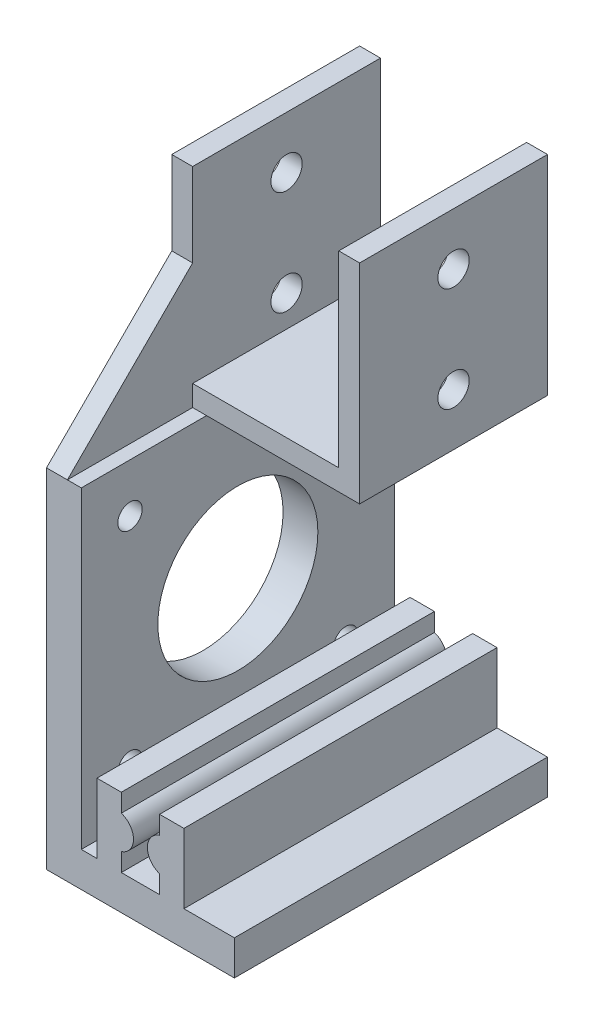
ISO-10303-21;
HEADER;
FILE_DESCRIPTION(('STEP AP214'),'2;1');
FILE_NAME('part.step','',(''),(''),'','','');
FILE_SCHEMA(('AUTOMOTIVE_DESIGN { 1 0 10303 214 1 1 1 1 }'));
ENDSEC;
DATA;
#1=APPLICATION_CONTEXT('core data for automotive mechanical design processes');
#2=APPLICATION_PROTOCOL_DEFINITION('international standard','automotive_design',2000,#1);
#3=PRODUCT_CONTEXT('',#1,'mechanical');
#4=PRODUCT('Part','Part','',(#3));
#5=PRODUCT_RELATED_PRODUCT_CATEGORY('part','',(#4));
#6=PRODUCT_DEFINITION_FORMATION('','',#4);
#7=PRODUCT_DEFINITION_CONTEXT('part definition',#1,'design');
#8=PRODUCT_DEFINITION('design','',#6,#7);
#9=PRODUCT_DEFINITION_SHAPE('','',#8);
#10=(LENGTH_UNIT() NAMED_UNIT(*) SI_UNIT(.MILLI.,.METRE.));
#11=(NAMED_UNIT(*) PLANE_ANGLE_UNIT() SI_UNIT($,.RADIAN.));
#12=(NAMED_UNIT(*) SI_UNIT($,.STERADIAN.) SOLID_ANGLE_UNIT());
#13=UNCERTAINTY_MEASURE_WITH_UNIT(LENGTH_MEASURE(1.E-05),#10,'distance_accuracy_value','');
#14=(GEOMETRIC_REPRESENTATION_CONTEXT(3) GLOBAL_UNCERTAINTY_ASSIGNED_CONTEXT((#13)) GLOBAL_UNIT_ASSIGNED_CONTEXT((#10,
#11,#12)) REPRESENTATION_CONTEXT('',''));
#15=CARTESIAN_POINT('',(0.,0.,0.));
#16=DIRECTION('',(0.,0.,1.));
#17=DIRECTION('',(1.,0.,0.));
#18=AXIS2_PLACEMENT_3D('',#15,#16,#17);
#19=CARTESIAN_POINT('',(-13.5,30.0000000000001,13.5));
#20=DIRECTION('',(0.,0.,-1.));
#21=DIRECTION('',(-1.,0.,0.));
#22=AXIS2_PLACEMENT_3D('',#19,#20,#21);
#23=PLANE('',#22);
#24=DIRECTION('',(1.,0.,0.));
#25=VECTOR('',#24,1.);
#26=CARTESIAN_POINT('',(-38.9558441227157,18.,13.5));
#27=LINE('',#26,#25);
#28=CARTESIAN_POINT('',(-13.5,18.,13.5));
#29=VERTEX_POINT('',#28);
#30=CARTESIAN_POINT('',(-10.5,18.,13.5));
#31=VERTEX_POINT('',#30);
#32=EDGE_CURVE('E246',#29,#31,#27,.T.);
#33=ORIENTED_EDGE('',*,*,#32,.T.);
#34=DIRECTION('',(0.,1.,0.));
#35=VECTOR('',#34,1.);
#36=CARTESIAN_POINT('',(-10.5,30.0000000000001,13.5));
#37=LINE('',#36,#35);
#38=CARTESIAN_POINT('',(-10.5,30.0000000000001,13.5));
#39=VERTEX_POINT('',#38);
#40=EDGE_CURVE('E255',#31,#39,#37,.T.);
#41=ORIENTED_EDGE('',*,*,#40,.T.);
#42=DIRECTION('',(1.,0.,0.));
#43=VECTOR('',#42,1.);
#44=CARTESIAN_POINT('',(-13.5,30.0000000000001,13.5));
#45=LINE('',#44,#43);
#46=CARTESIAN_POINT('',(-13.5,30.0000000000001,13.5));
#47=VERTEX_POINT('',#46);
#48=EDGE_CURVE('E352',#47,#39,#45,.T.);
#49=ORIENTED_EDGE('',*,*,#48,.F.);
#50=DIRECTION('',(0.,-1.,0.));
#51=VECTOR('',#50,1.);
#52=CARTESIAN_POINT('',(-13.5,30.0000000000001,13.5));
#53=LINE('',#52,#51);
#54=EDGE_CURVE('E370',#47,#29,#53,.T.);
#55=ORIENTED_EDGE('',*,*,#54,.T.);
#56=EDGE_LOOP('',(#33,#41,#49,#55));
#57=FACE_BOUND('',#56,.T.);
#58=ADVANCED_FACE('F56',(#57),#23,.F.);
#59=CARTESIAN_POINT('',(13.5,-45.,-13.5));
#60=DIRECTION('',(0.,-1.,0.));
#61=DIRECTION('',(0.,0.,-1.));
#62=AXIS2_PLACEMENT_3D('',#59,#60,#61);
#63=PLANE('',#62);
#64=DIRECTION('',(0.,0.,1.));
#65=VECTOR('',#64,1.);
#66=CARTESIAN_POINT('',(2.75,-44.9999999999999,-13.5));
#67=LINE('',#66,#65);
#68=CARTESIAN_POINT('',(2.75,-44.9999999999999,-13.5));
#69=VERTEX_POINT('',#68);
#70=CARTESIAN_POINT('',(2.75,-44.9999999999999,31.5));
#71=VERTEX_POINT('',#70);
#72=EDGE_CURVE('E618',#69,#71,#67,.T.);
#73=ORIENTED_EDGE('',*,*,#72,.F.);
#74=DIRECTION('',(-1.,0.,0.));
#75=VECTOR('',#74,1.);
#76=CARTESIAN_POINT('',(13.5,-45.,-13.5));
#77=LINE('',#76,#75);
#78=CARTESIAN_POINT('',(-2.75,-45.,-13.5));
#79=VERTEX_POINT('',#78);
#80=EDGE_CURVE('E746',#69,#79,#77,.T.);
#81=ORIENTED_EDGE('',*,*,#80,.T.);
#82=DIRECTION('',(0.,0.,1.));
#83=VECTOR('',#82,1.);
#84=CARTESIAN_POINT('',(-2.75,-45.,-13.5));
#85=LINE('',#84,#83);
#86=CARTESIAN_POINT('',(-2.75,-45.,31.5));
#87=VERTEX_POINT('',#86);
#88=EDGE_CURVE('E696',#79,#87,#85,.T.);
#89=ORIENTED_EDGE('',*,*,#88,.T.);
#90=DIRECTION('',(-1.,0.,0.));
#91=VECTOR('',#90,1.);
#92=CARTESIAN_POINT('',(13.5,-45.,31.5));
#93=LINE('',#92,#91);
#94=EDGE_CURVE('E740',#71,#87,#93,.T.);
#95=ORIENTED_EDGE('',*,*,#94,.F.);
#96=EDGE_LOOP('',(#73,#81,#89,#95));
#97=FACE_BOUND('',#96,.T.);
#98=ADVANCED_FACE('F461',(#97),#63,.F.);
#99=DIRECTION('',(0.,0.,1.));
#100=VECTOR('',#99,1.);
#101=CARTESIAN_POINT('',(-6.25,-45.,-13.5));
#102=LINE('',#101,#100);
#103=CARTESIAN_POINT('',(-6.25,-45.,-13.5));
#104=VERTEX_POINT('',#103);
#105=CARTESIAN_POINT('',(-6.24999999999999,-45.,31.5));
#106=VERTEX_POINT('',#105);
#107=EDGE_CURVE('E701',#104,#106,#102,.T.);
#108=ORIENTED_EDGE('',*,*,#107,.F.);
#109=CARTESIAN_POINT('',(-8.5,-44.9999999999999,-13.5));
#110=VERTEX_POINT('',#109);
#111=EDGE_CURVE('E739',#104,#110,#77,.T.);
#112=ORIENTED_EDGE('',*,*,#111,.T.);
#113=DIRECTION('',(0.,0.,1.));
#114=VECTOR('',#113,1.);
#115=CARTESIAN_POINT('',(-8.5,-44.9999999999999,-13.5));
#116=LINE('',#115,#114);
#117=CARTESIAN_POINT('',(-8.49999999999999,-44.9999999999999,31.5));
#118=VERTEX_POINT('',#117);
#119=EDGE_CURVE('E700',#110,#118,#116,.T.);
#120=ORIENTED_EDGE('',*,*,#119,.T.);
#121=EDGE_CURVE('E731',#106,#118,#93,.T.);
#122=ORIENTED_EDGE('',*,*,#121,.F.);
#123=EDGE_LOOP('',(#108,#112,#120,#122));
#124=FACE_BOUND('',#123,.T.);
#125=ADVANCED_FACE('F467',(#124),#63,.F.);
#126=CARTESIAN_POINT('',(-8.5,-44.9999999999999,-13.5));
#127=DIRECTION('',(-1.,0.,0.));
#128=DIRECTION('',(0.,0.,1.));
#129=AXIS2_PLACEMENT_3D('',#126,#127,#128);
#130=PLANE('',#129);
#131=CARTESIAN_POINT('',(-8.5,-37.9999999999999,24.5));
#132=DIRECTION('',(1.,0.,0.));
#133=DIRECTION('',(0.,0.,-1.));
#134=AXIS2_PLACEMENT_3D('',#131,#132,#133);
#135=CIRCLE('',#134,1.75);
#136=CARTESIAN_POINT('',(-8.5,-37.9999999999999,22.75));
#137=VERTEX_POINT('',#136);
#138=EDGE_CURVE('E761',#137,#137,#135,.T.);
#139=ORIENTED_EDGE('',*,*,#138,.F.);
#140=EDGE_LOOP('',(#139));
#141=FACE_BOUND('',#140,.T.);
#142=CARTESIAN_POINT('',(-8.5,-6.9999999999999,24.5));
#143=DIRECTION('',(1.,0.,0.));
#144=DIRECTION('',(0.,0.,-1.));
#145=AXIS2_PLACEMENT_3D('',#142,#143,#144);
#146=CIRCLE('',#145,1.75);
#147=CARTESIAN_POINT('',(-8.5,-6.9999999999999,22.75));
#148=VERTEX_POINT('',#147);
#149=EDGE_CURVE('E757',#148,#148,#146,.T.);
#150=ORIENTED_EDGE('',*,*,#149,.F.);
#151=EDGE_LOOP('',(#150));
#152=FACE_BOUND('',#151,.T.);
#153=CARTESIAN_POINT('',(-8.49999999999999,-6.9999999999999,-6.49999999999999));
#154=DIRECTION('',(1.,0.,0.));
#155=DIRECTION('',(0.,0.,-1.));
#156=AXIS2_PLACEMENT_3D('',#153,#154,#155);
#157=CIRCLE('',#156,1.75);
#158=CARTESIAN_POINT('',(-8.49999999999999,-6.9999999999999,-8.24999999999999));
#159=VERTEX_POINT('',#158);
#160=EDGE_CURVE('E762',#159,#159,#157,.T.);
#161=ORIENTED_EDGE('',*,*,#160,.F.);
#162=EDGE_LOOP('',(#161));
#163=FACE_BOUND('',#162,.T.);
#164=CARTESIAN_POINT('',(-8.49999999999999,-37.9999999999999,-6.49999999999999));
#165=DIRECTION('',(1.,0.,0.));
#166=DIRECTION('',(0.,0.,-1.));
#167=AXIS2_PLACEMENT_3D('',#164,#165,#166);
#168=CIRCLE('',#167,1.75);
#169=CARTESIAN_POINT('',(-8.49999999999999,-37.9999999999999,-8.24999999999999));
#170=VERTEX_POINT('',#169);
#171=EDGE_CURVE('E766',#170,#170,#168,.T.);
#172=ORIENTED_EDGE('',*,*,#171,.F.);
#173=EDGE_LOOP('',(#172));
#174=FACE_BOUND('',#173,.T.);
#175=CARTESIAN_POINT('',(-8.5,-22.5,9.00000000000001));
#176=DIRECTION('',(1.,0.,0.));
#177=DIRECTION('',(0.,0.,-1.));
#178=AXIS2_PLACEMENT_3D('',#175,#176,#177);
#179=CIRCLE('',#178,11.5);
#180=CARTESIAN_POINT('',(-8.5,-22.5,-2.49999999999999));
#181=VERTEX_POINT('',#180);
#182=EDGE_CURVE('E754',#181,#181,#179,.T.);
#183=ORIENTED_EDGE('',*,*,#182,.F.);
#184=EDGE_LOOP('',(#183));
#185=FACE_BOUND('',#184,.T.);
#186=ORIENTED_EDGE('',*,*,#119,.F.);
#187=DIRECTION('',(0.,1.,0.));
#188=VECTOR('',#187,1.);
#189=CARTESIAN_POINT('',(-8.5,-44.9999999999999,-13.5));
#190=LINE('',#189,#188);
#191=CARTESIAN_POINT('',(-8.5,1.11022302462516E-13,-13.5));
#192=VERTEX_POINT('',#191);
#193=EDGE_CURVE('E287',#110,#192,#190,.T.);
#194=ORIENTED_EDGE('',*,*,#193,.T.);
#195=DIRECTION('',(0.,0.,1.));
#196=VECTOR('',#195,1.);
#197=CARTESIAN_POINT('',(-8.5,1.11022302462516E-13,-13.5));
#198=LINE('',#197,#196);
#199=CARTESIAN_POINT('',(-8.49999999999999,1.11022302462516E-13,13.5));
#200=VERTEX_POINT('',#199);
#201=EDGE_CURVE('E274',#192,#200,#198,.T.);
#202=ORIENTED_EDGE('',*,*,#201,.T.);
#203=CARTESIAN_POINT('',(-8.49999999999999,1.11022302462516E-13,31.5));
#204=VERTEX_POINT('',#203);
#205=EDGE_CURVE('E281',#200,#204,#198,.T.);
#206=ORIENTED_EDGE('',*,*,#205,.T.);
#207=DIRECTION('',(0.,1.,0.));
#208=VECTOR('',#207,1.);
#209=CARTESIAN_POINT('',(-8.49999999999999,-44.9999999999999,31.5));
#210=LINE('',#209,#208);
#211=EDGE_CURVE('E270',#118,#204,#210,.T.);
#212=ORIENTED_EDGE('',*,*,#211,.F.);
#213=EDGE_LOOP('',(#186,#194,#202,#206,#212));
#214=FACE_BOUND('',#213,.T.);
#215=ADVANCED_FACE('F524',(#141,#152,#163,#174,#185,#214),#130,.F.);
#216=CARTESIAN_POINT('',(0.,0.,0.));
#217=DIRECTION('',(0.,1.,0.));
#218=DIRECTION('',(0.,0.,1.));
#219=AXIS2_PLACEMENT_3D('',#216,#217,#218);
#220=PLANE('',#219);
#221=ORIENTED_EDGE('',*,*,#201,.F.);
#222=DIRECTION('',(-1.,0.,0.));
#223=VECTOR('',#222,1.);
#224=CARTESIAN_POINT('',(-13.5,0.,-13.5));
#225=LINE('',#224,#223);
#226=CARTESIAN_POINT('',(13.5,1.11022302462516E-13,-13.5));
#227=VERTEX_POINT('',#226);
#228=EDGE_CURVE('E360',#227,#192,#225,.T.);
#229=ORIENTED_EDGE('',*,*,#228,.F.);
#230=DIRECTION('',(0.,0.,-1.));
#231=VECTOR('',#230,1.);
#232=CARTESIAN_POINT('',(13.5,1.11022302462516E-13,-13.5));
#233=LINE('',#232,#231);
#234=CARTESIAN_POINT('',(13.5,1.11022302462516E-13,13.5));
#235=VERTEX_POINT('',#234);
#236=EDGE_CURVE('E338',#235,#227,#233,.T.);
#237=ORIENTED_EDGE('',*,*,#236,.F.);
#238=DIRECTION('',(1.,0.,0.));
#239=VECTOR('',#238,1.);
#240=CARTESIAN_POINT('',(-13.5,0.,13.5));
#241=LINE('',#240,#239);
#242=EDGE_CURVE('E364',#200,#235,#241,.T.);
#243=ORIENTED_EDGE('',*,*,#242,.F.);
#244=EDGE_LOOP('',(#221,#229,#237,#243));
#245=FACE_BOUND('',#244,.T.);
#246=ADVANCED_FACE('F413',(#245),#220,.F.);
#247=CARTESIAN_POINT('',(0.,30.,0.));
#248=DIRECTION('',(0.,1.,0.));
#249=DIRECTION('',(0.,0.,1.));
#250=AXIS2_PLACEMENT_3D('',#247,#248,#249);
#251=PLANE('',#250);
#252=DIRECTION('',(0.,0.,1.));
#253=VECTOR('',#252,1.);
#254=CARTESIAN_POINT('',(-10.5,30.0000000000001,0.));
#255=LINE('',#254,#253);
#256=CARTESIAN_POINT('',(-10.5,30.0000000000001,-13.5));
#257=VERTEX_POINT('',#256);
#258=EDGE_CURVE('E66',#257,#39,#255,.T.);
#259=ORIENTED_EDGE('',*,*,#258,.F.);
#260=DIRECTION('',(-1.,0.,0.));
#261=VECTOR('',#260,1.);
#262=CARTESIAN_POINT('',(-13.5,30.0000000000001,-13.5));
#263=LINE('',#262,#261);
#264=CARTESIAN_POINT('',(-13.5,30.0000000000001,-13.5));
#265=VERTEX_POINT('',#264);
#266=EDGE_CURVE('E343',#257,#265,#263,.T.);
#267=ORIENTED_EDGE('',*,*,#266,.T.);
#268=DIRECTION('',(0.,0.,1.));
#269=VECTOR('',#268,1.);
#270=CARTESIAN_POINT('',(-13.5,30.0000000000001,-13.5));
#271=LINE('',#270,#269);
#272=EDGE_CURVE('E348',#265,#47,#271,.T.);
#273=ORIENTED_EDGE('',*,*,#272,.T.);
#274=ORIENTED_EDGE('',*,*,#48,.T.);
#275=EDGE_LOOP('',(#259,#267,#273,#274));
#276=FACE_BOUND('',#275,.T.);
#277=ADVANCED_FACE('F404',(#276),#251,.T.);
#278=CARTESIAN_POINT('',(13.5,30.,-13.5));
#279=DIRECTION('',(-1.,0.,0.));
#280=DIRECTION('',(0.,0.,1.));
#281=AXIS2_PLACEMENT_3D('',#278,#279,#280);
#282=PLANE('',#281);
#283=CARTESIAN_POINT('',(13.5,7.50000000000006,0.));
#284=DIRECTION('',(-1.,0.,0.));
#285=DIRECTION('',(0.,0.,1.));
#286=AXIS2_PLACEMENT_3D('',#283,#284,#285);
#287=CIRCLE('',#286,2.25);
#288=CARTESIAN_POINT('',(13.5,7.50000000000006,2.25));
#289=VERTEX_POINT('',#288);
#290=EDGE_CURVE('E311',#289,#289,#287,.T.);
#291=ORIENTED_EDGE('',*,*,#290,.T.);
#292=EDGE_LOOP('',(#291));
#293=FACE_BOUND('',#292,.T.);
#294=CARTESIAN_POINT('',(13.5,22.5000000000002,0.));
#295=DIRECTION('',(-1.,0.,0.));
#296=DIRECTION('',(0.,0.,1.));
#297=AXIS2_PLACEMENT_3D('',#294,#295,#296);
#298=CIRCLE('',#297,2.25);
#299=CARTESIAN_POINT('',(13.5,22.5000000000002,2.25));
#300=VERTEX_POINT('',#299);
#301=EDGE_CURVE('E303',#300,#300,#298,.T.);
#302=ORIENTED_EDGE('',*,*,#301,.T.);
#303=EDGE_LOOP('',(#302));
#304=FACE_BOUND('',#303,.T.);
#305=ORIENTED_EDGE('',*,*,#236,.T.);
#306=DIRECTION('',(0.,-1.,0.));
#307=VECTOR('',#306,1.);
#308=CARTESIAN_POINT('',(13.5,30.,-13.5));
#309=LINE('',#308,#307);
#310=CARTESIAN_POINT('',(13.5,30.,-13.5));
#311=VERTEX_POINT('',#310);
#312=EDGE_CURVE('E377',#311,#227,#309,.T.);
#313=ORIENTED_EDGE('',*,*,#312,.F.);
#314=DIRECTION('',(0.,0.,-1.));
#315=VECTOR('',#314,1.);
#316=CARTESIAN_POINT('',(13.5,30.,-13.5));
#317=LINE('',#316,#315);
#318=CARTESIAN_POINT('',(13.5,30.,13.5));
#319=VERTEX_POINT('',#318);
#320=EDGE_CURVE('E339',#319,#311,#317,.T.);
#321=ORIENTED_EDGE('',*,*,#320,.F.);
#322=DIRECTION('',(0.,-1.,0.));
#323=VECTOR('',#322,1.);
#324=CARTESIAN_POINT('',(13.5,30.,13.5));
#325=LINE('',#324,#323);
#326=EDGE_CURVE('E356',#319,#235,#325,.T.);
#327=ORIENTED_EDGE('',*,*,#326,.T.);
#328=EDGE_LOOP('',(#305,#313,#321,#327));
#329=FACE_BOUND('',#328,.T.);
#330=ADVANCED_FACE('F58',(#293,#304,#329),#282,.F.);
#331=CARTESIAN_POINT('',(-13.5,30.0000000000001,-13.5));
#332=DIRECTION('',(0.,0.,1.));
#333=DIRECTION('',(1.,0.,0.));
#334=AXIS2_PLACEMENT_3D('',#331,#332,#333);
#335=PLANE('',#334);
#336=ORIENTED_EDGE('',*,*,#266,.F.);
#337=DIRECTION('',(0.,1.,0.));
#338=VECTOR('',#337,1.);
#339=CARTESIAN_POINT('',(-10.5,3.00000000000011,-13.5));
#340=LINE('',#339,#338);
#341=CARTESIAN_POINT('',(-10.5,3.00000000000011,-13.5));
#342=VERTEX_POINT('',#341);
#343=EDGE_CURVE('E315',#342,#257,#340,.T.);
#344=ORIENTED_EDGE('',*,*,#343,.F.);
#345=DIRECTION('',(-1.,0.,0.));
#346=VECTOR('',#345,1.);
#347=CARTESIAN_POINT('',(10.5,3.,-13.5));
#348=LINE('',#347,#346);
#349=CARTESIAN_POINT('',(10.5,3.,-13.5));
#350=VERTEX_POINT('',#349);
#351=EDGE_CURVE('E322',#350,#342,#348,.T.);
#352=ORIENTED_EDGE('',*,*,#351,.F.);
#353=DIRECTION('',(0.,-1.,0.));
#354=VECTOR('',#353,1.);
#355=CARTESIAN_POINT('',(10.5,30.0000000000001,-13.5));
#356=LINE('',#355,#354);
#357=CARTESIAN_POINT('',(10.5,30.0000000000001,-13.5));
#358=VERTEX_POINT('',#357);
#359=EDGE_CURVE('E318',#358,#350,#356,.T.);
#360=ORIENTED_EDGE('',*,*,#359,.F.);
#361=EDGE_CURVE('E344',#311,#358,#263,.T.);
#362=ORIENTED_EDGE('',*,*,#361,.F.);
#363=ORIENTED_EDGE('',*,*,#312,.T.);
#364=ORIENTED_EDGE('',*,*,#228,.T.);
#365=ORIENTED_EDGE('',*,*,#193,.F.);
#366=ORIENTED_EDGE('',*,*,#111,.F.);
#367=DIRECTION('',(0.,1.,0.));
#368=VECTOR('',#367,1.);
#369=CARTESIAN_POINT('',(-6.24999999999999,1.11022302462516E-13,-13.5));
#370=LINE('',#369,#368);
#371=CARTESIAN_POINT('',(-6.25000000000001,-34.9999999999999,-13.5));
#372=VERTEX_POINT('',#371);
#373=EDGE_CURVE('E678',#104,#372,#370,.T.);
#374=ORIENTED_EDGE('',*,*,#373,.T.);
#375=DIRECTION('',(1.,0.,0.));
#376=VECTOR('',#375,1.);
#377=CARTESIAN_POINT('',(0.,-35.,-13.5));
#378=LINE('',#377,#376);
#379=CARTESIAN_POINT('',(-2.75,-34.9999999999999,-13.5));
#380=VERTEX_POINT('',#379);
#381=EDGE_CURVE('E675',#372,#380,#378,.T.);
#382=ORIENTED_EDGE('',*,*,#381,.T.);
#383=DIRECTION('',(0.,1.,0.));
#384=VECTOR('',#383,1.);
#385=CARTESIAN_POINT('',(-2.75,1.11022302462516E-13,-13.5));
#386=LINE('',#385,#384);
#387=CARTESIAN_POINT('',(-2.75,-37.6151519964577,-13.5));
#388=VERTEX_POINT('',#387);
#389=EDGE_CURVE('E671',#388,#380,#386,.T.);
#390=ORIENTED_EDGE('',*,*,#389,.F.);
#391=CARTESIAN_POINT('',(-3.5,-39.9999999999999,-13.5));
#392=DIRECTION('',(0.,0.,1.));
#393=DIRECTION('',(1.,0.,0.));
#394=AXIS2_PLACEMENT_3D('',#391,#392,#393);
#395=CIRCLE('',#394,2.5);
#396=CARTESIAN_POINT('',(-2.75,-42.3848480035424,-13.5));
#397=VERTEX_POINT('',#396);
#398=EDGE_CURVE('E670',#397,#388,#395,.T.);
#399=ORIENTED_EDGE('',*,*,#398,.F.);
#400=EDGE_CURVE('E666',#79,#397,#386,.T.);
#401=ORIENTED_EDGE('',*,*,#400,.F.);
#402=ORIENTED_EDGE('',*,*,#80,.F.);
#403=DIRECTION('',(0.,1.,0.));
#404=VECTOR('',#403,1.);
#405=CARTESIAN_POINT('',(2.75,0.,-13.5));
#406=LINE('',#405,#404);
#407=CARTESIAN_POINT('',(2.75,-42.3848480035424,-13.5));
#408=VERTEX_POINT('',#407);
#409=EDGE_CURVE('E835',#69,#408,#406,.T.);
#410=ORIENTED_EDGE('',*,*,#409,.T.);
#411=CARTESIAN_POINT('',(3.5,-40.,-13.5));
#412=DIRECTION('',(0.,0.,1.));
#413=DIRECTION('',(1.,0.,0.));
#414=AXIS2_PLACEMENT_3D('',#411,#412,#413);
#415=CIRCLE('',#414,2.5);
#416=CARTESIAN_POINT('',(2.75,-37.6151519964576,-13.5));
#417=VERTEX_POINT('',#416);
#418=EDGE_CURVE('E628',#408,#417,#415,.F.);
#419=ORIENTED_EDGE('',*,*,#418,.T.);
#420=CARTESIAN_POINT('',(2.75,-35.,-13.5));
#421=VERTEX_POINT('',#420);
#422=EDGE_CURVE('E630',#417,#421,#406,.T.);
#423=ORIENTED_EDGE('',*,*,#422,.T.);
#424=DIRECTION('',(-1.,0.,0.));
#425=VECTOR('',#424,1.);
#426=CARTESIAN_POINT('',(0.,-35.,-13.5));
#427=LINE('',#426,#425);
#428=CARTESIAN_POINT('',(6.25000000000001,-34.9999999999999,-13.5));
#429=VERTEX_POINT('',#428);
#430=EDGE_CURVE('E641',#429,#421,#427,.T.);
#431=ORIENTED_EDGE('',*,*,#430,.F.);
#432=DIRECTION('',(0.,1.,0.));
#433=VECTOR('',#432,1.);
#434=CARTESIAN_POINT('',(6.24999999999999,0.,-13.5));
#435=LINE('',#434,#433);
#436=CARTESIAN_POINT('',(6.25,-45.,-13.5));
#437=VERTEX_POINT('',#436);
#438=EDGE_CURVE('E839',#437,#429,#435,.T.);
#439=ORIENTED_EDGE('',*,*,#438,.F.);
#440=CARTESIAN_POINT('',(13.5,-45.,-13.5));
#441=VERTEX_POINT('',#440);
#442=EDGE_CURVE('E741',#441,#437,#77,.T.);
#443=ORIENTED_EDGE('',*,*,#442,.F.);
#444=DIRECTION('',(0.,1.,0.));
#445=VECTOR('',#444,1.);
#446=CARTESIAN_POINT('',(13.5,-50.,-13.5));
#447=LINE('',#446,#445);
#448=CARTESIAN_POINT('',(13.5,-50.,-13.5));
#449=VERTEX_POINT('',#448);
#450=EDGE_CURVE('E716',#449,#441,#447,.T.);
#451=ORIENTED_EDGE('',*,*,#450,.F.);
#452=DIRECTION('',(1.,0.,0.));
#453=VECTOR('',#452,1.);
#454=CARTESIAN_POINT('',(-13.5,-49.9999999999998,-13.5));
#455=LINE('',#454,#453);
#456=CARTESIAN_POINT('',(-13.5,-49.9999999999998,-13.5));
#457=VERTEX_POINT('',#456);
#458=EDGE_CURVE('E751',#457,#449,#455,.T.);
#459=ORIENTED_EDGE('',*,*,#458,.F.);
#460=DIRECTION('',(0.,-1.,0.));
#461=VECTOR('',#460,1.);
#462=CARTESIAN_POINT('',(-13.5,30.0000000000001,-13.5));
#463=LINE('',#462,#461);
#464=EDGE_CURVE('E374',#265,#457,#463,.T.);
#465=ORIENTED_EDGE('',*,*,#464,.F.);
#466=EDGE_LOOP('',(#336,#344,#352,#360,#362,#363,#364,#365,#366,#374,#382,#390,#399,#401,#402,
#410,#419,#423,#431,#439,#443,#451,#459,#465));
#467=FACE_BOUND('',#466,.T.);
#468=ADVANCED_FACE('F403',(#467),#335,.F.);
#469=CARTESIAN_POINT('',(-13.5,30.0000000000001,-13.5));
#470=DIRECTION('',(1.,0.,0.));
#471=DIRECTION('',(0.,0.,-1.));
#472=AXIS2_PLACEMENT_3D('',#469,#470,#471);
#473=PLANE('',#472);
#474=DIRECTION('',(0.,-0.707106781186548,0.707106781186547));
#475=VECTOR('',#474,1.);
#476=CARTESIAN_POINT('',(-13.5,9.00000000000012,22.5));
#477=LINE('',#476,#475);
#478=CARTESIAN_POINT('',(-13.5,0.,31.5));
#479=VERTEX_POINT('',#478);
#480=EDGE_CURVE('E242',#29,#479,#477,.T.);
#481=ORIENTED_EDGE('',*,*,#480,.F.);
#482=ORIENTED_EDGE('',*,*,#54,.F.);
#483=ORIENTED_EDGE('',*,*,#272,.F.);
#484=ORIENTED_EDGE('',*,*,#464,.T.);
#485=DIRECTION('',(0.,0.,-1.));
#486=VECTOR('',#485,1.);
#487=CARTESIAN_POINT('',(-13.5,-49.9999999999998,-13.5));
#488=LINE('',#487,#486);
#489=CARTESIAN_POINT('',(-13.5,-49.9999999999999,31.5));
#490=VERTEX_POINT('',#489);
#491=EDGE_CURVE('E745',#490,#457,#488,.T.);
#492=ORIENTED_EDGE('',*,*,#491,.F.);
#493=DIRECTION('',(0.,1.,0.));
#494=VECTOR('',#493,1.);
#495=CARTESIAN_POINT('',(-13.5,-44.9999999999999,31.5));
#496=LINE('',#495,#494);
#497=EDGE_CURVE('E273',#490,#479,#496,.T.);
#498=ORIENTED_EDGE('',*,*,#497,.T.);
#499=EDGE_LOOP('',(#481,#482,#483,#484,#492,#498));
#500=FACE_BOUND('',#499,.T.);
#501=CARTESIAN_POINT('',(-13.5,-22.5,9.00000000000001));
#502=DIRECTION('',(1.,0.,0.));
#503=DIRECTION('',(0.,0.,-1.));
#504=AXIS2_PLACEMENT_3D('',#501,#502,#503);
#505=CIRCLE('',#504,11.5);
#506=CARTESIAN_POINT('',(-13.5,-22.5,-2.49999999999999));
#507=VERTEX_POINT('',#506);
#508=EDGE_CURVE('E490',#507,#507,#505,.T.);
#509=ORIENTED_EDGE('',*,*,#508,.T.);
#510=EDGE_LOOP('',(#509));
#511=FACE_BOUND('',#510,.T.);
#512=CARTESIAN_POINT('',(-13.5,-38.,-6.49999999999999));
#513=DIRECTION('',(1.,0.,0.));
#514=DIRECTION('',(0.,0.,-1.));
#515=AXIS2_PLACEMENT_3D('',#512,#513,#514);
#516=CIRCLE('',#515,1.75);
#517=CARTESIAN_POINT('',(-13.5,-38.,-8.24999999999999));
#518=VERTEX_POINT('',#517);
#519=EDGE_CURVE('E494',#518,#518,#516,.T.);
#520=ORIENTED_EDGE('',*,*,#519,.T.);
#521=EDGE_LOOP('',(#520));
#522=FACE_BOUND('',#521,.T.);
#523=CARTESIAN_POINT('',(-13.5,-6.9999999999999,-6.49999999999999));
#524=DIRECTION('',(1.,0.,0.));
#525=DIRECTION('',(0.,0.,-1.));
#526=AXIS2_PLACEMENT_3D('',#523,#524,#525);
#527=CIRCLE('',#526,1.75);
#528=CARTESIAN_POINT('',(-13.5,-6.9999999999999,-8.24999999999999));
#529=VERTEX_POINT('',#528);
#530=EDGE_CURVE('E498',#529,#529,#527,.T.);
#531=ORIENTED_EDGE('',*,*,#530,.T.);
#532=EDGE_LOOP('',(#531));
#533=FACE_BOUND('',#532,.T.);
#534=CARTESIAN_POINT('',(-13.5,-6.9999999999999,24.5));
#535=DIRECTION('',(1.,0.,0.));
#536=DIRECTION('',(0.,0.,-1.));
#537=AXIS2_PLACEMENT_3D('',#534,#535,#536);
#538=CIRCLE('',#537,1.75);
#539=CARTESIAN_POINT('',(-13.5,-6.9999999999999,22.75));
#540=VERTEX_POINT('',#539);
#541=EDGE_CURVE('E502',#540,#540,#538,.T.);
#542=ORIENTED_EDGE('',*,*,#541,.T.);
#543=EDGE_LOOP('',(#542));
#544=FACE_BOUND('',#543,.T.);
#545=CARTESIAN_POINT('',(-13.5,-38.,24.5));
#546=DIRECTION('',(1.,0.,0.));
#547=DIRECTION('',(0.,0.,-1.));
#548=AXIS2_PLACEMENT_3D('',#545,#546,#547);
#549=CIRCLE('',#548,1.75);
#550=CARTESIAN_POINT('',(-13.5,-38.,22.75));
#551=VERTEX_POINT('',#550);
#552=EDGE_CURVE('E506',#551,#551,#549,.T.);
#553=ORIENTED_EDGE('',*,*,#552,.T.);
#554=EDGE_LOOP('',(#553));
#555=FACE_BOUND('',#554,.T.);
#556=CARTESIAN_POINT('',(-13.5,7.50000000000006,0.));
#557=DIRECTION('',(-1.,0.,0.));
#558=DIRECTION('',(0.,0.,1.));
#559=AXIS2_PLACEMENT_3D('',#556,#557,#558);
#560=CIRCLE('',#559,2.25);
#561=CARTESIAN_POINT('',(-13.5,7.50000000000006,2.25000000000001));
#562=VERTEX_POINT('',#561);
#563=EDGE_CURVE('E291',#562,#562,#560,.T.);
#564=ORIENTED_EDGE('',*,*,#563,.F.);
#565=EDGE_LOOP('',(#564));
#566=FACE_BOUND('',#565,.T.);
#567=CARTESIAN_POINT('',(-13.5,22.5000000000001,0.));
#568=DIRECTION('',(-1.,0.,0.));
#569=DIRECTION('',(0.,0.,1.));
#570=AXIS2_PLACEMENT_3D('',#567,#568,#569);
#571=CIRCLE('',#570,2.25);
#572=CARTESIAN_POINT('',(-13.5,22.5000000000001,2.25000000000001));
#573=VERTEX_POINT('',#572);
#574=EDGE_CURVE('E290',#573,#573,#571,.T.);
#575=ORIENTED_EDGE('',*,*,#574,.F.);
#576=EDGE_LOOP('',(#575));
#577=FACE_BOUND('',#576,.T.);
#578=ADVANCED_FACE('F474',(#500,#511,#522,#533,#544,#555,#566,#577),#473,.F.);
#579=DIRECTION('',(-1.,0.,0.));
#580=VECTOR('',#579,1.);
#581=CARTESIAN_POINT('',(-13.5,3.00000000000011,13.5));
#582=LINE('',#581,#580);
#583=CARTESIAN_POINT('',(10.5,3.,13.5));
#584=VERTEX_POINT('',#583);
#585=CARTESIAN_POINT('',(-10.5,3.00000000000011,13.5));
#586=VERTEX_POINT('',#585);
#587=EDGE_CURVE('E13',#584,#586,#582,.T.);
#588=ORIENTED_EDGE('',*,*,#587,.T.);
#589=DIRECTION('',(0.,-1.,0.));
#590=VECTOR('',#589,1.);
#591=CARTESIAN_POINT('',(-10.5,3.00000000000011,13.5));
#592=LINE('',#591,#590);
#593=CARTESIAN_POINT('',(-10.5,0.,13.5));
#594=VERTEX_POINT('',#593);
#595=EDGE_CURVE('E257',#586,#594,#592,.T.);
#596=ORIENTED_EDGE('',*,*,#595,.T.);
#597=EDGE_CURVE('E265',#594,#200,#241,.T.);
#598=ORIENTED_EDGE('',*,*,#597,.T.);
#599=ORIENTED_EDGE('',*,*,#242,.T.);
#600=ORIENTED_EDGE('',*,*,#326,.F.);
#601=CARTESIAN_POINT('',(10.5,30.0000000000001,13.5));
#602=VERTEX_POINT('',#601);
#603=EDGE_CURVE('E351',#602,#319,#45,.T.);
#604=ORIENTED_EDGE('',*,*,#603,.F.);
#605=DIRECTION('',(0.,-1.,0.));
#606=VECTOR('',#605,1.);
#607=CARTESIAN_POINT('',(10.5,30.0000000000001,13.5));
#608=LINE('',#607,#606);
#609=EDGE_CURVE('E330',#602,#584,#608,.T.);
#610=ORIENTED_EDGE('',*,*,#609,.T.);
#611=EDGE_LOOP('',(#588,#596,#598,#599,#600,#604,#610));
#612=FACE_BOUND('',#611,.T.);
#613=ADVANCED_FACE('F425',(#612),#23,.F.);
#614=DIRECTION('',(0.,0.,-1.));
#615=VECTOR('',#614,1.);
#616=CARTESIAN_POINT('',(10.5,30.0000000000001,0.));
#617=LINE('',#616,#615);
#618=EDGE_CURVE('E381',#602,#358,#617,.T.);
#619=ORIENTED_EDGE('',*,*,#618,.F.);
#620=ORIENTED_EDGE('',*,*,#603,.T.);
#621=ORIENTED_EDGE('',*,*,#320,.T.);
#622=ORIENTED_EDGE('',*,*,#361,.T.);
#623=EDGE_LOOP('',(#619,#620,#621,#622));
#624=FACE_BOUND('',#623,.T.);
#625=ADVANCED_FACE('F421',(#624),#251,.T.);
#626=CARTESIAN_POINT('',(10.5,3.,16.5));
#627=DIRECTION('',(0.,-1.,0.));
#628=DIRECTION('',(0.,0.,-1.));
#629=AXIS2_PLACEMENT_3D('',#626,#627,#628);
#630=PLANE('',#629);
#631=DIRECTION('',(0.,0.,-1.));
#632=VECTOR('',#631,1.);
#633=CARTESIAN_POINT('',(10.5,3.,16.5));
#634=LINE('',#633,#632);
#635=EDGE_CURVE('E326',#584,#350,#634,.T.);
#636=ORIENTED_EDGE('',*,*,#635,.T.);
#637=ORIENTED_EDGE('',*,*,#351,.T.);
#638=DIRECTION('',(0.,0.,-1.));
#639=VECTOR('',#638,1.);
#640=CARTESIAN_POINT('',(-10.5,3.00000000000011,16.5));
#641=LINE('',#640,#639);
#642=EDGE_CURVE('E327',#586,#342,#641,.T.);
#643=ORIENTED_EDGE('',*,*,#642,.F.);
#644=ORIENTED_EDGE('',*,*,#587,.F.);
#645=EDGE_LOOP('',(#636,#637,#643,#644));
#646=FACE_BOUND('',#645,.T.);
#647=ADVANCED_FACE('F479',(#646),#630,.F.);
#648=CARTESIAN_POINT('',(-10.5,3.00000000000011,16.5));
#649=DIRECTION('',(-1.,0.,0.));
#650=DIRECTION('',(0.,0.,1.));
#651=AXIS2_PLACEMENT_3D('',#648,#649,#650);
#652=PLANE('',#651);
#653=CARTESIAN_POINT('',(-10.5,7.50000000000006,0.));
#654=DIRECTION('',(-1.,0.,0.));
#655=DIRECTION('',(0.,0.,1.));
#656=AXIS2_PLACEMENT_3D('',#653,#654,#655);
#657=CIRCLE('',#656,2.25);
#658=CARTESIAN_POINT('',(-10.5,7.50000000000006,2.25000000000001));
#659=VERTEX_POINT('',#658);
#660=EDGE_CURVE('E307',#659,#659,#657,.T.);
#661=ORIENTED_EDGE('',*,*,#660,.T.);
#662=EDGE_LOOP('',(#661));
#663=FACE_BOUND('',#662,.T.);
#664=CARTESIAN_POINT('',(-10.5,22.5000000000001,0.));
#665=DIRECTION('',(-1.,0.,0.));
#666=DIRECTION('',(0.,0.,1.));
#667=AXIS2_PLACEMENT_3D('',#664,#665,#666);
#668=CIRCLE('',#667,2.25);
#669=CARTESIAN_POINT('',(-10.5,22.5000000000001,2.25000000000001));
#670=VERTEX_POINT('',#669);
#671=EDGE_CURVE('E299',#670,#670,#668,.T.);
#672=ORIENTED_EDGE('',*,*,#671,.T.);
#673=EDGE_LOOP('',(#672));
#674=FACE_BOUND('',#673,.T.);
#675=ORIENTED_EDGE('',*,*,#642,.T.);
#676=ORIENTED_EDGE('',*,*,#343,.T.);
#677=ORIENTED_EDGE('',*,*,#258,.T.);
#678=ORIENTED_EDGE('',*,*,#40,.F.);
#679=DIRECTION('',(0.,0.707106781186548,-0.707106781186547));
#680=VECTOR('',#679,1.);
#681=CARTESIAN_POINT('',(-10.5,9.00000000000001,22.5));
#682=LINE('',#681,#680);
#683=CARTESIAN_POINT('',(-10.5,0.,31.5));
#684=VERTEX_POINT('',#683);
#685=EDGE_CURVE('E240',#684,#31,#682,.T.);
#686=ORIENTED_EDGE('',*,*,#685,.F.);
#687=DIRECTION('',(0.,0.,1.));
#688=VECTOR('',#687,1.);
#689=CARTESIAN_POINT('',(-10.5,0.,16.5));
#690=LINE('',#689,#688);
#691=EDGE_CURVE('E252',#594,#684,#690,.T.);
#692=ORIENTED_EDGE('',*,*,#691,.F.);
#693=ORIENTED_EDGE('',*,*,#595,.F.);
#694=EDGE_LOOP('',(#675,#676,#677,#678,#686,#692,#693));
#695=FACE_BOUND('',#694,.T.);
#696=ADVANCED_FACE('F251',(#663,#674,#695),#652,.F.);
#697=CARTESIAN_POINT('',(10.5,30.0000000000001,16.5));
#698=DIRECTION('',(1.,0.,0.));
#699=DIRECTION('',(0.,1.,0.));
#700=AXIS2_PLACEMENT_3D('',#697,#698,#699);
#701=PLANE('',#700);
#702=CARTESIAN_POINT('',(10.5,7.50000000000006,0.));
#703=DIRECTION('',(1.,0.,0.));
#704=DIRECTION('',(0.,1.,0.));
#705=AXIS2_PLACEMENT_3D('',#702,#703,#704);
#706=CIRCLE('',#705,2.25);
#707=CARTESIAN_POINT('',(10.5,9.75000000000006,0.));
#708=VERTEX_POINT('',#707);
#709=EDGE_CURVE('E60',#708,#708,#706,.T.);
#710=ORIENTED_EDGE('',*,*,#709,.T.);
#711=EDGE_LOOP('',(#710));
#712=FACE_BOUND('',#711,.T.);
#713=CARTESIAN_POINT('',(10.5,22.5000000000002,0.));
#714=DIRECTION('',(1.,0.,0.));
#715=DIRECTION('',(0.,1.,0.));
#716=AXIS2_PLACEMENT_3D('',#713,#714,#715);
#717=CIRCLE('',#716,2.25);
#718=CARTESIAN_POINT('',(10.5,24.7500000000002,0.));
#719=VERTEX_POINT('',#718);
#720=EDGE_CURVE('E295',#719,#719,#717,.T.);
#721=ORIENTED_EDGE('',*,*,#720,.T.);
#722=EDGE_LOOP('',(#721));
#723=FACE_BOUND('',#722,.T.);
#724=ORIENTED_EDGE('',*,*,#618,.T.);
#725=ORIENTED_EDGE('',*,*,#359,.T.);
#726=ORIENTED_EDGE('',*,*,#635,.F.);
#727=ORIENTED_EDGE('',*,*,#609,.F.);
#728=EDGE_LOOP('',(#724,#725,#726,#727));
#729=FACE_BOUND('',#728,.T.);
#730=ADVANCED_FACE('F390',(#712,#723,#729),#701,.F.);
#731=CARTESIAN_POINT('',(16.5,22.5000000000001,0.));
#732=DIRECTION('',(-1.,0.,0.));
#733=DIRECTION('',(0.,0.,1.));
#734=AXIS2_PLACEMENT_3D('',#731,#732,#733);
#735=CYLINDRICAL_SURFACE('',#734,2.25);
#736=ORIENTED_EDGE('',*,*,#720,.F.);
#737=EDGE_LOOP('',(#736));
#738=FACE_BOUND('',#737,.T.);
#739=ORIENTED_EDGE('',*,*,#301,.F.);
#740=EDGE_LOOP('',(#739));
#741=FACE_BOUND('',#740,.T.);
#742=ADVANCED_FACE('F393',(#738,#741),#735,.F.);
#743=CARTESIAN_POINT('',(16.5,7.50000000000006,0.));
#744=DIRECTION('',(-1.,0.,0.));
#745=DIRECTION('',(0.,0.,1.));
#746=AXIS2_PLACEMENT_3D('',#743,#744,#745);
#747=CYLINDRICAL_SURFACE('',#746,2.25);
#748=ORIENTED_EDGE('',*,*,#709,.F.);
#749=EDGE_LOOP('',(#748));
#750=FACE_BOUND('',#749,.T.);
#751=ORIENTED_EDGE('',*,*,#290,.F.);
#752=EDGE_LOOP('',(#751));
#753=FACE_BOUND('',#752,.T.);
#754=ADVANCED_FACE('F396',(#750,#753),#747,.F.);
#755=ORIENTED_EDGE('',*,*,#574,.T.);
#756=EDGE_LOOP('',(#755));
#757=FACE_BOUND('',#756,.T.);
#758=ORIENTED_EDGE('',*,*,#671,.F.);
#759=EDGE_LOOP('',(#758));
#760=FACE_BOUND('',#759,.T.);
#761=ADVANCED_FACE('F398',(#757,#760),#735,.F.);
#762=ORIENTED_EDGE('',*,*,#563,.T.);
#763=EDGE_LOOP('',(#762));
#764=FACE_BOUND('',#763,.T.);
#765=ORIENTED_EDGE('',*,*,#660,.F.);
#766=EDGE_LOOP('',(#765));
#767=FACE_BOUND('',#766,.T.);
#768=ADVANCED_FACE('F451',(#764,#767),#747,.F.);
#769=CARTESIAN_POINT('',(0.,0.,0.));
#770=DIRECTION('',(0.,1.,0.));
#771=DIRECTION('',(0.,0.,1.));
#772=AXIS2_PLACEMENT_3D('',#769,#770,#771);
#773=PLANE('',#772);
#774=ORIENTED_EDGE('',*,*,#691,.T.);
#775=DIRECTION('',(-1.,0.,0.));
#776=VECTOR('',#775,1.);
#777=CARTESIAN_POINT('',(-13.5,0.,31.5));
#778=LINE('',#777,#776);
#779=EDGE_CURVE('E264',#204,#684,#778,.T.);
#780=ORIENTED_EDGE('',*,*,#779,.F.);
#781=ORIENTED_EDGE('',*,*,#205,.F.);
#782=ORIENTED_EDGE('',*,*,#597,.F.);
#783=EDGE_LOOP('',(#774,#780,#781,#782));
#784=FACE_BOUND('',#783,.T.);
#785=ADVANCED_FACE('F262',(#784),#773,.T.);
#786=CARTESIAN_POINT('',(-13.5,-44.9999999999999,31.5));
#787=DIRECTION('',(0.,0.,-1.));
#788=DIRECTION('',(-1.,0.,0.));
#789=AXIS2_PLACEMENT_3D('',#786,#787,#788);
#790=PLANE('',#789);
#791=ORIENTED_EDGE('',*,*,#779,.T.);
#792=DIRECTION('',(1.,0.,0.));
#793=VECTOR('',#792,1.);
#794=CARTESIAN_POINT('',(-38.9558441227157,1.11022302462516E-13,31.5));
#795=LINE('',#794,#793);
#796=EDGE_CURVE('E236',#479,#684,#795,.T.);
#797=ORIENTED_EDGE('',*,*,#796,.F.);
#798=ORIENTED_EDGE('',*,*,#497,.F.);
#799=DIRECTION('',(1.,0.,0.));
#800=VECTOR('',#799,1.);
#801=CARTESIAN_POINT('',(-13.5,-49.9999999999999,31.5));
#802=LINE('',#801,#800);
#803=CARTESIAN_POINT('',(13.5,-50.,31.5));
#804=VERTEX_POINT('',#803);
#805=EDGE_CURVE('E750',#490,#804,#802,.T.);
#806=ORIENTED_EDGE('',*,*,#805,.T.);
#807=DIRECTION('',(0.,-1.,0.));
#808=VECTOR('',#807,1.);
#809=CARTESIAN_POINT('',(13.5,-50.,31.5));
#810=LINE('',#809,#808);
#811=CARTESIAN_POINT('',(13.5,-45.,31.5));
#812=VERTEX_POINT('',#811);
#813=EDGE_CURVE('E723',#812,#804,#810,.T.);
#814=ORIENTED_EDGE('',*,*,#813,.F.);
#815=CARTESIAN_POINT('',(6.25000000000001,-45.,31.5));
#816=VERTEX_POINT('',#815);
#817=EDGE_CURVE('E735',#812,#816,#93,.T.);
#818=ORIENTED_EDGE('',*,*,#817,.T.);
#819=DIRECTION('',(0.,1.,0.));
#820=VECTOR('',#819,1.);
#821=CARTESIAN_POINT('',(6.25,0.,31.5));
#822=LINE('',#821,#820);
#823=CARTESIAN_POINT('',(6.25000000000001,-34.9999999999999,31.5));
#824=VERTEX_POINT('',#823);
#825=EDGE_CURVE('E621',#816,#824,#822,.T.);
#826=ORIENTED_EDGE('',*,*,#825,.T.);
#827=DIRECTION('',(-1.,0.,0.));
#828=VECTOR('',#827,1.);
#829=CARTESIAN_POINT('',(0.,-35.,31.5));
#830=LINE('',#829,#828);
#831=CARTESIAN_POINT('',(2.75000000000001,-35.,31.5));
#832=VERTEX_POINT('',#831);
#833=EDGE_CURVE('E647',#824,#832,#830,.T.);
#834=ORIENTED_EDGE('',*,*,#833,.T.);
#835=DIRECTION('',(0.,1.,0.));
#836=VECTOR('',#835,1.);
#837=CARTESIAN_POINT('',(2.75000000000001,0.,31.5));
#838=LINE('',#837,#836);
#839=CARTESIAN_POINT('',(2.75000000000001,-37.6151519964576,31.5));
#840=VERTEX_POINT('',#839);
#841=EDGE_CURVE('E624',#840,#832,#838,.T.);
#842=ORIENTED_EDGE('',*,*,#841,.F.);
#843=CARTESIAN_POINT('',(3.5,-40.,31.5));
#844=DIRECTION('',(0.,0.,1.));
#845=DIRECTION('',(1.,0.,0.));
#846=AXIS2_PLACEMENT_3D('',#843,#844,#845);
#847=CIRCLE('',#846,2.5);
#848=CARTESIAN_POINT('',(2.75,-42.3848480035424,31.5));
#849=VERTEX_POINT('',#848);
#850=EDGE_CURVE('E622',#849,#840,#847,.F.);
#851=ORIENTED_EDGE('',*,*,#850,.F.);
#852=EDGE_CURVE('E74',#71,#849,#838,.T.);
#853=ORIENTED_EDGE('',*,*,#852,.F.);
#854=ORIENTED_EDGE('',*,*,#94,.T.);
#855=DIRECTION('',(0.,1.,0.));
#856=VECTOR('',#855,1.);
#857=CARTESIAN_POINT('',(-2.75,1.11022302462516E-13,31.5));
#858=LINE('',#857,#856);
#859=CARTESIAN_POINT('',(-2.74999999999999,-42.3848480035424,31.5));
#860=VERTEX_POINT('',#859);
#861=EDGE_CURVE('E653',#87,#860,#858,.T.);
#862=ORIENTED_EDGE('',*,*,#861,.T.);
#863=CARTESIAN_POINT('',(-3.49999999999999,-39.9999999999999,31.5));
#864=DIRECTION('',(0.,0.,1.));
#865=DIRECTION('',(1.,0.,0.));
#866=AXIS2_PLACEMENT_3D('',#863,#864,#865);
#867=CIRCLE('',#866,2.5);
#868=CARTESIAN_POINT('',(-2.75,-37.6151519964577,31.5));
#869=VERTEX_POINT('',#868);
#870=EDGE_CURVE('E685',#860,#869,#867,.T.);
#871=ORIENTED_EDGE('',*,*,#870,.T.);
#872=CARTESIAN_POINT('',(-2.75,-34.9999999999999,31.5));
#873=VERTEX_POINT('',#872);
#874=EDGE_CURVE('E686',#869,#873,#858,.T.);
#875=ORIENTED_EDGE('',*,*,#874,.T.);
#876=DIRECTION('',(1.,0.,0.));
#877=VECTOR('',#876,1.);
#878=CARTESIAN_POINT('',(0.,-35.,31.5));
#879=LINE('',#878,#877);
#880=CARTESIAN_POINT('',(-6.25,-34.9999999999999,31.5));
#881=VERTEX_POINT('',#880);
#882=EDGE_CURVE('E690',#881,#873,#879,.T.);
#883=ORIENTED_EDGE('',*,*,#882,.F.);
#884=DIRECTION('',(0.,1.,0.));
#885=VECTOR('',#884,1.);
#886=CARTESIAN_POINT('',(-6.24999999999999,1.11022302462516E-13,31.5));
#887=LINE('',#886,#885);
#888=EDGE_CURVE('E81',#106,#881,#887,.T.);
#889=ORIENTED_EDGE('',*,*,#888,.F.);
#890=ORIENTED_EDGE('',*,*,#121,.T.);
#891=ORIENTED_EDGE('',*,*,#211,.T.);
#892=EDGE_LOOP('',(#791,#797,#798,#806,#814,#818,#826,#834,#842,#851,#853,#854,#862,#871,#875,
#883,#889,#890,#891));
#893=FACE_BOUND('',#892,.T.);
#894=ADVANCED_FACE('F268',(#893),#790,.F.);
#895=CARTESIAN_POINT('',(-18.5,-38.,24.5));
#896=DIRECTION('',(1.,0.,0.));
#897=DIRECTION('',(0.,0.,-1.));
#898=AXIS2_PLACEMENT_3D('',#895,#896,#897);
#899=CYLINDRICAL_SURFACE('',#898,1.75);
#900=ORIENTED_EDGE('',*,*,#138,.T.);
#901=EDGE_LOOP('',(#900));
#902=FACE_BOUND('',#901,.T.);
#903=ORIENTED_EDGE('',*,*,#552,.F.);
#904=EDGE_LOOP('',(#903));
#905=FACE_BOUND('',#904,.T.);
#906=ADVANCED_FACE('F540',(#902,#905),#899,.F.);
#907=CARTESIAN_POINT('',(-18.5,-7.00000000000001,24.5));
#908=DIRECTION('',(1.,0.,0.));
#909=DIRECTION('',(0.,0.,-1.));
#910=AXIS2_PLACEMENT_3D('',#907,#908,#909);
#911=CYLINDRICAL_SURFACE('',#910,1.75);
#912=ORIENTED_EDGE('',*,*,#149,.T.);
#913=EDGE_LOOP('',(#912));
#914=FACE_BOUND('',#913,.T.);
#915=ORIENTED_EDGE('',*,*,#541,.F.);
#916=EDGE_LOOP('',(#915));
#917=FACE_BOUND('',#916,.T.);
#918=ADVANCED_FACE('F545',(#914,#917),#911,.F.);
#919=CARTESIAN_POINT('',(-18.5,-7.00000000000001,-6.49999999999999));
#920=DIRECTION('',(1.,0.,0.));
#921=DIRECTION('',(0.,0.,-1.));
#922=AXIS2_PLACEMENT_3D('',#919,#920,#921);
#923=CYLINDRICAL_SURFACE('',#922,1.75);
#924=ORIENTED_EDGE('',*,*,#160,.T.);
#925=EDGE_LOOP('',(#924));
#926=FACE_BOUND('',#925,.T.);
#927=ORIENTED_EDGE('',*,*,#530,.F.);
#928=EDGE_LOOP('',(#927));
#929=FACE_BOUND('',#928,.T.);
#930=ADVANCED_FACE('F555',(#926,#929),#923,.F.);
#931=CARTESIAN_POINT('',(-18.5,-38.,-6.49999999999999));
#932=DIRECTION('',(1.,0.,0.));
#933=DIRECTION('',(0.,0.,-1.));
#934=AXIS2_PLACEMENT_3D('',#931,#932,#933);
#935=CYLINDRICAL_SURFACE('',#934,1.75);
#936=ORIENTED_EDGE('',*,*,#171,.T.);
#937=EDGE_LOOP('',(#936));
#938=FACE_BOUND('',#937,.T.);
#939=ORIENTED_EDGE('',*,*,#519,.F.);
#940=EDGE_LOOP('',(#939));
#941=FACE_BOUND('',#940,.T.);
#942=ADVANCED_FACE('F551',(#938,#941),#935,.F.);
#943=CARTESIAN_POINT('',(-18.5,-22.5,9.00000000000001));
#944=DIRECTION('',(1.,0.,0.));
#945=DIRECTION('',(0.,0.,-1.));
#946=AXIS2_PLACEMENT_3D('',#943,#944,#945);
#947=CYLINDRICAL_SURFACE('',#946,11.5);
#948=ORIENTED_EDGE('',*,*,#182,.T.);
#949=EDGE_LOOP('',(#948));
#950=FACE_BOUND('',#949,.T.);
#951=ORIENTED_EDGE('',*,*,#508,.F.);
#952=EDGE_LOOP('',(#951));
#953=FACE_BOUND('',#952,.T.);
#954=ADVANCED_FACE('F547',(#950,#953),#947,.F.);
#955=CARTESIAN_POINT('',(-13.5,-49.9999999999998,-13.5));
#956=DIRECTION('',(0.,-1.,0.));
#957=DIRECTION('',(0.,0.,-1.));
#958=AXIS2_PLACEMENT_3D('',#955,#956,#957);
#959=PLANE('',#958);
#960=ORIENTED_EDGE('',*,*,#458,.T.);
#961=DIRECTION('',(0.,0.,-1.));
#962=VECTOR('',#961,1.);
#963=CARTESIAN_POINT('',(13.5,-50.,-13.5));
#964=LINE('',#963,#962);
#965=EDGE_CURVE('E727',#804,#449,#964,.T.);
#966=ORIENTED_EDGE('',*,*,#965,.F.);
#967=ORIENTED_EDGE('',*,*,#805,.F.);
#968=ORIENTED_EDGE('',*,*,#491,.T.);
#969=EDGE_LOOP('',(#960,#966,#967,#968));
#970=FACE_BOUND('',#969,.T.);
#971=ADVANCED_FACE('F550',(#970),#959,.T.);
#972=ORIENTED_EDGE('',*,*,#442,.T.);
#973=DIRECTION('',(0.,0.,1.));
#974=VECTOR('',#973,1.);
#975=CARTESIAN_POINT('',(6.25,-45.,-13.5));
#976=LINE('',#975,#974);
#977=EDGE_CURVE('E660',#437,#816,#976,.T.);
#978=ORIENTED_EDGE('',*,*,#977,.T.);
#979=ORIENTED_EDGE('',*,*,#817,.F.);
#980=DIRECTION('',(0.,0.,1.));
#981=VECTOR('',#980,1.);
#982=CARTESIAN_POINT('',(13.5,-45.,-13.5));
#983=LINE('',#982,#981);
#984=EDGE_CURVE('E720',#441,#812,#983,.T.);
#985=ORIENTED_EDGE('',*,*,#984,.F.);
#986=EDGE_LOOP('',(#972,#978,#979,#985));
#987=FACE_BOUND('',#986,.T.);
#988=ADVANCED_FACE('F470',(#987),#63,.F.);
#989=CARTESIAN_POINT('',(13.5,1.11022302462516E-13,0.));
#990=DIRECTION('',(1.,0.,0.));
#991=DIRECTION('',(0.,0.,-1.));
#992=AXIS2_PLACEMENT_3D('',#989,#990,#991);
#993=PLANE('',#992);
#994=ORIENTED_EDGE('',*,*,#450,.T.);
#995=ORIENTED_EDGE('',*,*,#984,.T.);
#996=ORIENTED_EDGE('',*,*,#813,.T.);
#997=ORIENTED_EDGE('',*,*,#965,.T.);
#998=EDGE_LOOP('',(#994,#995,#996,#997));
#999=FACE_BOUND('',#998,.T.);
#1000=ADVANCED_FACE('F567',(#999),#993,.T.);
#1001=CARTESIAN_POINT('',(-2.75,1.11022302462516E-13,-13.5));
#1002=DIRECTION('',(1.,0.,0.));
#1003=DIRECTION('',(0.,0.,-1.));
#1004=AXIS2_PLACEMENT_3D('',#1001,#1002,#1003);
#1005=PLANE('',#1004);
#1006=ORIENTED_EDGE('',*,*,#861,.F.);
#1007=ORIENTED_EDGE('',*,*,#88,.F.);
#1008=ORIENTED_EDGE('',*,*,#400,.T.);
#1009=DIRECTION('',(0.,0.,1.));
#1010=VECTOR('',#1009,1.);
#1011=CARTESIAN_POINT('',(-2.75,-42.3848480035424,-13.5));
#1012=LINE('',#1011,#1010);
#1013=EDGE_CURVE('E681',#397,#860,#1012,.T.);
#1014=ORIENTED_EDGE('',*,*,#1013,.T.);
#1015=EDGE_LOOP('',(#1006,#1007,#1008,#1014));
#1016=FACE_BOUND('',#1015,.T.);
#1017=ADVANCED_FACE('F571',(#1016),#1005,.T.);
#1018=CARTESIAN_POINT('',(-6.24999999999999,1.11022302462516E-13,-13.5));
#1019=DIRECTION('',(1.,0.,0.));
#1020=DIRECTION('',(0.,1.,0.));
#1021=AXIS2_PLACEMENT_3D('',#1018,#1019,#1020);
#1022=PLANE('',#1021);
#1023=ORIENTED_EDGE('',*,*,#888,.T.);
#1024=DIRECTION('',(0.,0.,1.));
#1025=VECTOR('',#1024,1.);
#1026=CARTESIAN_POINT('',(-6.25000000000001,-34.9999999999999,-13.5));
#1027=LINE('',#1026,#1025);
#1028=EDGE_CURVE('E704',#372,#881,#1027,.T.);
#1029=ORIENTED_EDGE('',*,*,#1028,.F.);
#1030=ORIENTED_EDGE('',*,*,#373,.F.);
#1031=ORIENTED_EDGE('',*,*,#107,.T.);
#1032=EDGE_LOOP('',(#1023,#1029,#1030,#1031));
#1033=FACE_BOUND('',#1032,.T.);
#1034=ADVANCED_FACE('F585',(#1033),#1022,.F.);
#1035=CARTESIAN_POINT('',(0.,-35.,-13.5));
#1036=DIRECTION('',(0.,-1.,0.));
#1037=DIRECTION('',(0.,0.,-1.));
#1038=AXIS2_PLACEMENT_3D('',#1035,#1036,#1037);
#1039=PLANE('',#1038);
#1040=ORIENTED_EDGE('',*,*,#882,.T.);
#1041=DIRECTION('',(0.,0.,1.));
#1042=VECTOR('',#1041,1.);
#1043=CARTESIAN_POINT('',(-2.75,-34.9999999999999,-13.5));
#1044=LINE('',#1043,#1042);
#1045=EDGE_CURVE('E708',#380,#873,#1044,.T.);
#1046=ORIENTED_EDGE('',*,*,#1045,.F.);
#1047=ORIENTED_EDGE('',*,*,#381,.F.);
#1048=ORIENTED_EDGE('',*,*,#1028,.T.);
#1049=EDGE_LOOP('',(#1040,#1046,#1047,#1048));
#1050=FACE_BOUND('',#1049,.T.);
#1051=ADVANCED_FACE('F581',(#1050),#1039,.F.);
#1052=ORIENTED_EDGE('',*,*,#874,.F.);
#1053=DIRECTION('',(0.,0.,1.));
#1054=VECTOR('',#1053,1.);
#1055=CARTESIAN_POINT('',(-2.75,-37.6151519964577,-13.5));
#1056=LINE('',#1055,#1054);
#1057=EDGE_CURVE('E711',#388,#869,#1056,.T.);
#1058=ORIENTED_EDGE('',*,*,#1057,.F.);
#1059=ORIENTED_EDGE('',*,*,#389,.T.);
#1060=ORIENTED_EDGE('',*,*,#1045,.T.);
#1061=EDGE_LOOP('',(#1052,#1058,#1059,#1060));
#1062=FACE_BOUND('',#1061,.T.);
#1063=ADVANCED_FACE('F577',(#1062),#1005,.T.);
#1064=CARTESIAN_POINT('',(-3.5,-39.9999999999999,-13.5));
#1065=DIRECTION('',(0.,0.,1.));
#1066=DIRECTION('',(1.,0.,0.));
#1067=AXIS2_PLACEMENT_3D('',#1064,#1065,#1066);
#1068=CYLINDRICAL_SURFACE('',#1067,2.5);
#1069=ORIENTED_EDGE('',*,*,#870,.F.);
#1070=ORIENTED_EDGE('',*,*,#1013,.F.);
#1071=ORIENTED_EDGE('',*,*,#398,.T.);
#1072=ORIENTED_EDGE('',*,*,#1057,.T.);
#1073=EDGE_LOOP('',(#1069,#1070,#1071,#1072));
#1074=FACE_BOUND('',#1073,.T.);
#1075=ADVANCED_FACE('F573',(#1074),#1068,.T.);
#1076=CARTESIAN_POINT('',(3.5,-40.,-13.5));
#1077=DIRECTION('',(0.,0.,1.));
#1078=DIRECTION('',(1.,0.,0.));
#1079=AXIS2_PLACEMENT_3D('',#1076,#1077,#1078);
#1080=CYLINDRICAL_SURFACE('',#1079,2.5);
#1081=ORIENTED_EDGE('',*,*,#850,.T.);
#1082=DIRECTION('',(0.,0.,1.));
#1083=VECTOR('',#1082,1.);
#1084=CARTESIAN_POINT('',(2.75,-37.6151519964576,-13.5));
#1085=LINE('',#1084,#1083);
#1086=EDGE_CURVE('E650',#417,#840,#1085,.T.);
#1087=ORIENTED_EDGE('',*,*,#1086,.F.);
#1088=ORIENTED_EDGE('',*,*,#418,.F.);
#1089=DIRECTION('',(0.,0.,1.));
#1090=VECTOR('',#1089,1.);
#1091=CARTESIAN_POINT('',(2.75,-42.3848480035424,-13.5));
#1092=LINE('',#1091,#1090);
#1093=EDGE_CURVE('E615',#408,#849,#1092,.T.);
#1094=ORIENTED_EDGE('',*,*,#1093,.T.);
#1095=EDGE_LOOP('',(#1081,#1087,#1088,#1094));
#1096=FACE_BOUND('',#1095,.T.);
#1097=ADVANCED_FACE('F576',(#1096),#1080,.T.);
#1098=CARTESIAN_POINT('',(2.75,0.,-13.5));
#1099=DIRECTION('',(1.,0.,0.));
#1100=DIRECTION('',(0.,0.,-1.));
#1101=AXIS2_PLACEMENT_3D('',#1098,#1099,#1100);
#1102=PLANE('',#1101);
#1103=ORIENTED_EDGE('',*,*,#841,.T.);
#1104=DIRECTION('',(0.,0.,1.));
#1105=VECTOR('',#1104,1.);
#1106=CARTESIAN_POINT('',(2.75,-35.,-13.5));
#1107=LINE('',#1106,#1105);
#1108=EDGE_CURVE('E654',#421,#832,#1107,.T.);
#1109=ORIENTED_EDGE('',*,*,#1108,.F.);
#1110=ORIENTED_EDGE('',*,*,#422,.F.);
#1111=ORIENTED_EDGE('',*,*,#1086,.T.);
#1112=EDGE_LOOP('',(#1103,#1109,#1110,#1111));
#1113=FACE_BOUND('',#1112,.T.);
#1114=ADVANCED_FACE('F592',(#1113),#1102,.F.);
#1115=CARTESIAN_POINT('',(0.,-35.,-13.5));
#1116=DIRECTION('',(0.,1.,0.));
#1117=DIRECTION('',(0.,0.,1.));
#1118=AXIS2_PLACEMENT_3D('',#1115,#1116,#1117);
#1119=PLANE('',#1118);
#1120=ORIENTED_EDGE('',*,*,#833,.F.);
#1121=DIRECTION('',(0.,0.,1.));
#1122=VECTOR('',#1121,1.);
#1123=CARTESIAN_POINT('',(6.25000000000001,-34.9999999999999,-13.5));
#1124=LINE('',#1123,#1122);
#1125=EDGE_CURVE('E657',#429,#824,#1124,.T.);
#1126=ORIENTED_EDGE('',*,*,#1125,.F.);
#1127=ORIENTED_EDGE('',*,*,#430,.T.);
#1128=ORIENTED_EDGE('',*,*,#1108,.T.);
#1129=EDGE_LOOP('',(#1120,#1126,#1127,#1128));
#1130=FACE_BOUND('',#1129,.T.);
#1131=ADVANCED_FACE('F598',(#1130),#1119,.T.);
#1132=CARTESIAN_POINT('',(6.24999999999999,0.,-13.5));
#1133=DIRECTION('',(1.,0.,0.));
#1134=DIRECTION('',(0.,1.,0.));
#1135=AXIS2_PLACEMENT_3D('',#1132,#1133,#1134);
#1136=PLANE('',#1135);
#1137=ORIENTED_EDGE('',*,*,#825,.F.);
#1138=ORIENTED_EDGE('',*,*,#977,.F.);
#1139=ORIENTED_EDGE('',*,*,#438,.T.);
#1140=ORIENTED_EDGE('',*,*,#1125,.T.);
#1141=EDGE_LOOP('',(#1137,#1138,#1139,#1140));
#1142=FACE_BOUND('',#1141,.T.);
#1143=ADVANCED_FACE('F594',(#1142),#1136,.T.);
#1144=ORIENTED_EDGE('',*,*,#852,.T.);
#1145=ORIENTED_EDGE('',*,*,#1093,.F.);
#1146=ORIENTED_EDGE('',*,*,#409,.F.);
#1147=ORIENTED_EDGE('',*,*,#72,.T.);
#1148=EDGE_LOOP('',(#1144,#1145,#1146,#1147));
#1149=FACE_BOUND('',#1148,.T.);
#1150=ADVANCED_FACE('F597',(#1149),#1102,.F.);
#1151=CARTESIAN_POINT('',(-38.9558441227157,9.00000000000012,22.5));
#1152=DIRECTION('',(0.,-0.707106781186548,-0.707106781186548));
#1153=DIRECTION('',(0.,0.707106781186548,-0.707106781186547));
#1154=AXIS2_PLACEMENT_3D('',#1151,#1152,#1153);
#1155=PLANE('',#1154);
#1156=ORIENTED_EDGE('',*,*,#32,.F.);
#1157=ORIENTED_EDGE('',*,*,#480,.T.);
#1158=ORIENTED_EDGE('',*,*,#796,.T.);
#1159=ORIENTED_EDGE('',*,*,#685,.T.);
#1160=EDGE_LOOP('',(#1156,#1157,#1158,#1159));
#1161=FACE_BOUND('',#1160,.T.);
#1162=ADVANCED_FACE('F239',(#1161),#1155,.F.);
#1163=CLOSED_SHELL('',(#58,#98,#125,#215,#246,#277,#330,#468,#578,#613,#625,#647,#696,#730,#742,
#754,#761,#768,#785,#894,#906,#918,#930,#942,#954,#971,#988,#1000,#1017,#1034,#1051,#1063,#1075,
#1097,#1114,#1131,#1143,#1150,#1162));
#1164=MANIFOLD_SOLID_BREP('B2',#1163);
#1165=ADVANCED_BREP_SHAPE_REPRESENTATION('',(#18,#1164),#14);
#1166=SHAPE_DEFINITION_REPRESENTATION(#9,#1165);
ENDSEC;
END-ISO-10303-21;
